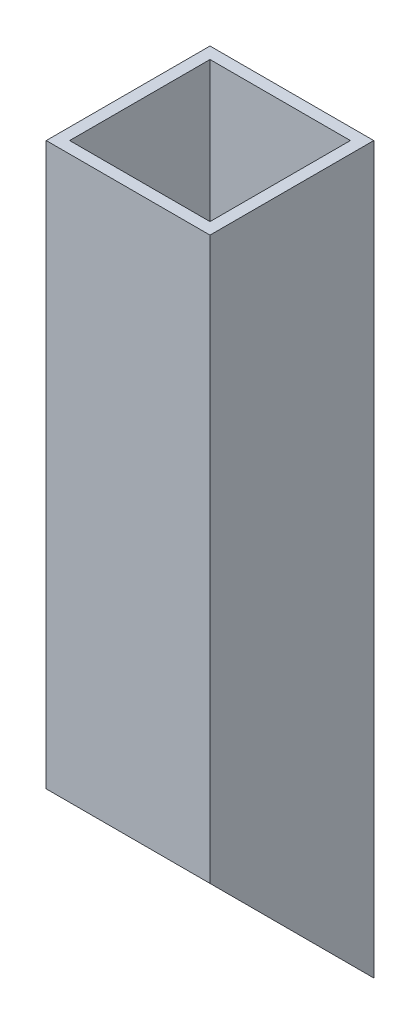
ISO-10303-21;
HEADER;
FILE_DESCRIPTION(('STEP AP214'),'2;1');
FILE_NAME('part.step','',(''),(''),'','','');
FILE_SCHEMA(('AUTOMOTIVE_DESIGN { 1 0 10303 214 1 1 1 1 }'));
ENDSEC;
DATA;
#1=APPLICATION_CONTEXT('core data for automotive mechanical design processes');
#2=APPLICATION_PROTOCOL_DEFINITION('international standard','automotive_design',2000,#1);
#3=PRODUCT_CONTEXT('',#1,'mechanical');
#4=PRODUCT('Part','Part','',(#3));
#5=PRODUCT_RELATED_PRODUCT_CATEGORY('part','',(#4));
#6=PRODUCT_DEFINITION_FORMATION('','',#4);
#7=PRODUCT_DEFINITION_CONTEXT('part definition',#1,'design');
#8=PRODUCT_DEFINITION('design','',#6,#7);
#9=PRODUCT_DEFINITION_SHAPE('','',#8);
#10=(LENGTH_UNIT() NAMED_UNIT(*) SI_UNIT(.MILLI.,.METRE.));
#11=(NAMED_UNIT(*) PLANE_ANGLE_UNIT() SI_UNIT($,.RADIAN.));
#12=(NAMED_UNIT(*) SI_UNIT($,.STERADIAN.) SOLID_ANGLE_UNIT());
#13=UNCERTAINTY_MEASURE_WITH_UNIT(LENGTH_MEASURE(1.E-05),#10,'distance_accuracy_value','');
#14=(GEOMETRIC_REPRESENTATION_CONTEXT(3) GLOBAL_UNCERTAINTY_ASSIGNED_CONTEXT((#13)) GLOBAL_UNIT_ASSIGNED_CONTEXT((#10,
#11,#12)) REPRESENTATION_CONTEXT('',''));
#15=CARTESIAN_POINT('',(0.,0.,0.));
#16=DIRECTION('',(0.,0.,1.));
#17=DIRECTION('',(1.,0.,0.));
#18=AXIS2_PLACEMENT_3D('',#15,#16,#17);
#19=CARTESIAN_POINT('',(1.89084858881472E-13,196.85,0.));
#20=DIRECTION('',(0.,-1.,0.));
#21=DIRECTION('',(0.,0.,-1.));
#22=AXIS2_PLACEMENT_3D('',#19,#20,#21);
#23=PLANE('',#22);
#24=DIRECTION('',(0.,0.,1.));
#25=VECTOR('',#24,1.);
#26=CARTESIAN_POINT('',(1.89084858881472E-13,196.85,0.));
#27=LINE('',#26,#25);
#28=CARTESIAN_POINT('',(1.89084858881472E-13,196.85,-44.45));
#29=VERTEX_POINT('',#28);
#30=CARTESIAN_POINT('',(1.89084858881472E-13,196.85,0.));
#31=VERTEX_POINT('',#30);
#32=EDGE_CURVE('E121',#29,#31,#27,.T.);
#33=ORIENTED_EDGE('',*,*,#32,.T.);
#34=DIRECTION('',(1.,0.,0.));
#35=VECTOR('',#34,1.);
#36=CARTESIAN_POINT('',(1.89084858881472E-13,196.85,0.));
#37=LINE('',#36,#35);
#38=CARTESIAN_POINT('',(44.4500000000002,196.85,0.));
#39=VERTEX_POINT('',#38);
#40=EDGE_CURVE('E127',#31,#39,#37,.T.);
#41=ORIENTED_EDGE('',*,*,#40,.T.);
#42=DIRECTION('',(0.,0.,-1.));
#43=VECTOR('',#42,1.);
#44=CARTESIAN_POINT('',(44.4500000000002,196.85,0.));
#45=LINE('',#44,#43);
#46=CARTESIAN_POINT('',(44.4500000000002,196.85,-44.45));
#47=VERTEX_POINT('',#46);
#48=EDGE_CURVE('E124',#39,#47,#45,.T.);
#49=ORIENTED_EDGE('',*,*,#48,.T.);
#50=DIRECTION('',(-1.,0.,0.));
#51=VECTOR('',#50,1.);
#52=CARTESIAN_POINT('',(1.89084858881472E-13,196.85,-44.45));
#53=LINE('',#52,#51);
#54=EDGE_CURVE('E118',#47,#29,#53,.T.);
#55=ORIENTED_EDGE('',*,*,#54,.T.);
#56=EDGE_LOOP('',(#33,#41,#49,#55));
#57=FACE_BOUND('',#56,.T.);
#58=DIRECTION('',(1.,0.,0.));
#59=VECTOR('',#58,1.);
#60=CARTESIAN_POINT('',(3.17500000000019,196.85,-3.175));
#61=LINE('',#60,#59);
#62=CARTESIAN_POINT('',(3.17500000000019,196.85,-3.175));
#63=VERTEX_POINT('',#62);
#64=CARTESIAN_POINT('',(41.2750000000002,196.85,-3.17499999999989));
#65=VERTEX_POINT('',#64);
#66=EDGE_CURVE('E89',#63,#65,#61,.T.);
#67=ORIENTED_EDGE('',*,*,#66,.F.);
#68=DIRECTION('',(0.,0.,1.));
#69=VECTOR('',#68,1.);
#70=CARTESIAN_POINT('',(3.17500000000019,196.85,-3.175));
#71=LINE('',#70,#69);
#72=CARTESIAN_POINT('',(3.17500000000019,196.85,-41.275));
#73=VERTEX_POINT('',#72);
#74=EDGE_CURVE('E137',#73,#63,#71,.T.);
#75=ORIENTED_EDGE('',*,*,#74,.F.);
#76=DIRECTION('',(-1.,0.,0.));
#77=VECTOR('',#76,1.);
#78=CARTESIAN_POINT('',(3.17500000000019,196.85,-41.275));
#79=LINE('',#78,#77);
#80=CARTESIAN_POINT('',(41.2750000000001,196.85,-41.275));
#81=VERTEX_POINT('',#80);
#82=EDGE_CURVE('E140',#81,#73,#79,.T.);
#83=ORIENTED_EDGE('',*,*,#82,.F.);
#84=DIRECTION('',(0.,0.,-1.));
#85=VECTOR('',#84,1.);
#86=CARTESIAN_POINT('',(41.2750000000002,196.85,-3.17499999999989));
#87=LINE('',#86,#85);
#88=EDGE_CURVE('E99',#65,#81,#87,.T.);
#89=ORIENTED_EDGE('',*,*,#88,.F.);
#90=EDGE_LOOP('',(#67,#75,#83,#89));
#91=FACE_BOUND('',#90,.T.);
#92=ADVANCED_FACE('F34',(#57,#91),#23,.F.);
#93=CARTESIAN_POINT('',(1.89084858881472E-13,196.85,0.));
#94=DIRECTION('',(1.,0.,0.));
#95=DIRECTION('',(0.,0.,-1.));
#96=AXIS2_PLACEMENT_3D('',#93,#94,#95);
#97=PLANE('',#96);
#98=DIRECTION('',(0.,-1.,0.));
#99=VECTOR('',#98,1.);
#100=CARTESIAN_POINT('',(1.89084858881472E-13,196.85,-44.45));
#101=LINE('',#100,#99);
#102=CARTESIAN_POINT('',(0.,0.,-44.45));
#103=VERTEX_POINT('',#102);
#104=EDGE_CURVE('E116',#29,#103,#101,.T.);
#105=ORIENTED_EDGE('',*,*,#104,.T.);
#106=DIRECTION('',(0.,0.707106781186546,0.707106781186549));
#107=VECTOR('',#106,1.);
#108=CARTESIAN_POINT('',(0.,44.45,0.));
#109=LINE('',#108,#107);
#110=CARTESIAN_POINT('',(0.,44.45,0.));
#111=VERTEX_POINT('',#110);
#112=EDGE_CURVE('E11',#103,#111,#109,.T.);
#113=ORIENTED_EDGE('',*,*,#112,.T.);
#114=DIRECTION('',(0.,-1.,0.));
#115=VECTOR('',#114,1.);
#116=CARTESIAN_POINT('',(1.89084858881472E-13,196.85,0.));
#117=LINE('',#116,#115);
#118=EDGE_CURVE('E108',#31,#111,#117,.T.);
#119=ORIENTED_EDGE('',*,*,#118,.F.);
#120=ORIENTED_EDGE('',*,*,#32,.F.);
#121=EDGE_LOOP('',(#105,#113,#119,#120));
#122=FACE_BOUND('',#121,.T.);
#123=ADVANCED_FACE('F174',(#122),#97,.F.);
#124=CARTESIAN_POINT('',(1.89084858881472E-13,196.85,0.));
#125=DIRECTION('',(0.,0.,-1.));
#126=DIRECTION('',(-1.,0.,0.));
#127=AXIS2_PLACEMENT_3D('',#124,#125,#126);
#128=PLANE('',#127);
#129=ORIENTED_EDGE('',*,*,#118,.T.);
#130=DIRECTION('',(1.,0.,0.));
#131=VECTOR('',#130,1.);
#132=CARTESIAN_POINT('',(44.4500000000001,44.4500000000001,0.));
#133=LINE('',#132,#131);
#134=CARTESIAN_POINT('',(44.4500000000001,44.4500000000001,0.));
#135=VERTEX_POINT('',#134);
#136=EDGE_CURVE('E105',#111,#135,#133,.T.);
#137=ORIENTED_EDGE('',*,*,#136,.T.);
#138=DIRECTION('',(0.,-1.,0.));
#139=VECTOR('',#138,1.);
#140=CARTESIAN_POINT('',(44.4500000000002,196.85,0.));
#141=LINE('',#140,#139);
#142=EDGE_CURVE('E110',#39,#135,#141,.T.);
#143=ORIENTED_EDGE('',*,*,#142,.F.);
#144=ORIENTED_EDGE('',*,*,#40,.F.);
#145=EDGE_LOOP('',(#129,#137,#143,#144));
#146=FACE_BOUND('',#145,.T.);
#147=ADVANCED_FACE('F178',(#146),#128,.F.);
#148=CARTESIAN_POINT('',(44.4500000000002,196.85,0.));
#149=DIRECTION('',(-1.,0.,0.));
#150=DIRECTION('',(0.,0.,1.));
#151=AXIS2_PLACEMENT_3D('',#148,#149,#150);
#152=PLANE('',#151);
#153=ORIENTED_EDGE('',*,*,#142,.T.);
#154=DIRECTION('',(0.,-0.707106781186546,-0.707106781186549));
#155=VECTOR('',#154,1.);
#156=CARTESIAN_POINT('',(44.4500000000001,44.4500000000001,0.));
#157=LINE('',#156,#155);
#158=CARTESIAN_POINT('',(44.45,1.2490009027033E-13,-44.45));
#159=VERTEX_POINT('',#158);
#160=EDGE_CURVE('E44',#135,#159,#157,.T.);
#161=ORIENTED_EDGE('',*,*,#160,.T.);
#162=DIRECTION('',(0.,-1.,0.));
#163=VECTOR('',#162,1.);
#164=CARTESIAN_POINT('',(44.4500000000002,196.85,-44.45));
#165=LINE('',#164,#163);
#166=EDGE_CURVE('E113',#47,#159,#165,.T.);
#167=ORIENTED_EDGE('',*,*,#166,.F.);
#168=ORIENTED_EDGE('',*,*,#48,.F.);
#169=EDGE_LOOP('',(#153,#161,#167,#168));
#170=FACE_BOUND('',#169,.T.);
#171=ADVANCED_FACE('F181',(#170),#152,.F.);
#172=CARTESIAN_POINT('',(1.89084858881472E-13,196.85,-44.45));
#173=DIRECTION('',(0.,0.,1.));
#174=DIRECTION('',(1.,0.,0.));
#175=AXIS2_PLACEMENT_3D('',#172,#173,#174);
#176=PLANE('',#175);
#177=DIRECTION('',(-1.,0.,0.));
#178=VECTOR('',#177,1.);
#179=CARTESIAN_POINT('',(0.,0.,-44.45));
#180=LINE('',#179,#178);
#181=EDGE_CURVE('E90',#159,#103,#180,.T.);
#182=ORIENTED_EDGE('',*,*,#181,.T.);
#183=ORIENTED_EDGE('',*,*,#104,.F.);
#184=ORIENTED_EDGE('',*,*,#54,.F.);
#185=ORIENTED_EDGE('',*,*,#166,.T.);
#186=EDGE_LOOP('',(#182,#183,#184,#185));
#187=FACE_BOUND('',#186,.T.);
#188=ADVANCED_FACE('F169',(#187),#176,.F.);
#189=CARTESIAN_POINT('',(3.17500000000019,196.85,-3.175));
#190=DIRECTION('',(0.,0.,-1.));
#191=DIRECTION('',(-1.,0.,0.));
#192=AXIS2_PLACEMENT_3D('',#189,#190,#191);
#193=PLANE('',#192);
#194=DIRECTION('',(1.,0.,0.));
#195=VECTOR('',#194,1.);
#196=CARTESIAN_POINT('',(0.,41.275,-3.175));
#197=LINE('',#196,#195);
#198=CARTESIAN_POINT('',(3.17500000000006,41.275,-3.175));
#199=VERTEX_POINT('',#198);
#200=CARTESIAN_POINT('',(41.2750000000001,41.2750000000001,-3.17499999999989));
#201=VERTEX_POINT('',#200);
#202=EDGE_CURVE('E38',#199,#201,#197,.T.);
#203=ORIENTED_EDGE('',*,*,#202,.F.);
#204=DIRECTION('',(0.,-1.,0.));
#205=VECTOR('',#204,1.);
#206=CARTESIAN_POINT('',(3.17500000000019,196.85,-3.175));
#207=LINE('',#206,#205);
#208=EDGE_CURVE('E135',#63,#199,#207,.T.);
#209=ORIENTED_EDGE('',*,*,#208,.F.);
#210=ORIENTED_EDGE('',*,*,#66,.T.);
#211=DIRECTION('',(0.,-1.,0.));
#212=VECTOR('',#211,1.);
#213=CARTESIAN_POINT('',(41.2750000000002,196.85,-3.17499999999989));
#214=LINE('',#213,#212);
#215=EDGE_CURVE('E73',#65,#201,#214,.T.);
#216=ORIENTED_EDGE('',*,*,#215,.T.);
#217=EDGE_LOOP('',(#203,#209,#210,#216));
#218=FACE_BOUND('',#217,.T.);
#219=ADVANCED_FACE('F85',(#218),#193,.T.);
#220=CARTESIAN_POINT('',(41.2750000000002,196.85,-3.17499999999989));
#221=DIRECTION('',(-1.,0.,0.));
#222=DIRECTION('',(0.,0.,1.));
#223=AXIS2_PLACEMENT_3D('',#220,#221,#222);
#224=PLANE('',#223);
#225=DIRECTION('',(0.,-0.707106781186546,-0.707106781186549));
#226=VECTOR('',#225,1.);
#227=CARTESIAN_POINT('',(41.2750000000001,44.4500000000001,1.11022302462516E-13));
#228=LINE('',#227,#226);
#229=CARTESIAN_POINT('',(41.2749999999999,3.17500000000018,-41.275));
#230=VERTEX_POINT('',#229);
#231=EDGE_CURVE('E69',#201,#230,#228,.T.);
#232=ORIENTED_EDGE('',*,*,#231,.F.);
#233=ORIENTED_EDGE('',*,*,#215,.F.);
#234=ORIENTED_EDGE('',*,*,#88,.T.);
#235=DIRECTION('',(0.,-1.,0.));
#236=VECTOR('',#235,1.);
#237=CARTESIAN_POINT('',(41.2750000000001,196.85,-41.275));
#238=LINE('',#237,#236);
#239=EDGE_CURVE('E76',#81,#230,#238,.T.);
#240=ORIENTED_EDGE('',*,*,#239,.T.);
#241=EDGE_LOOP('',(#232,#233,#234,#240));
#242=FACE_BOUND('',#241,.T.);
#243=ADVANCED_FACE('F71',(#242),#224,.T.);
#244=CARTESIAN_POINT('',(3.17500000000019,196.85,-41.275));
#245=DIRECTION('',(0.,0.,1.));
#246=DIRECTION('',(1.,0.,0.));
#247=AXIS2_PLACEMENT_3D('',#244,#245,#246);
#248=PLANE('',#247);
#249=DIRECTION('',(-1.,0.,0.));
#250=VECTOR('',#249,1.);
#251=CARTESIAN_POINT('',(0.,3.17500000000015,-41.275));
#252=LINE('',#251,#250);
#253=CARTESIAN_POINT('',(3.175,3.17500000000018,-41.275));
#254=VERTEX_POINT('',#253);
#255=EDGE_CURVE('E81',#230,#254,#252,.T.);
#256=ORIENTED_EDGE('',*,*,#255,.F.);
#257=ORIENTED_EDGE('',*,*,#239,.F.);
#258=ORIENTED_EDGE('',*,*,#82,.T.);
#259=DIRECTION('',(0.,-1.,0.));
#260=VECTOR('',#259,1.);
#261=CARTESIAN_POINT('',(3.17500000000019,196.85,-41.275));
#262=LINE('',#261,#260);
#263=EDGE_CURVE('E133',#73,#254,#262,.T.);
#264=ORIENTED_EDGE('',*,*,#263,.T.);
#265=EDGE_LOOP('',(#256,#257,#258,#264));
#266=FACE_BOUND('',#265,.T.);
#267=ADVANCED_FACE('F149',(#266),#248,.T.);
#268=CARTESIAN_POINT('',(3.17500000000019,196.85,-3.175));
#269=DIRECTION('',(1.,0.,0.));
#270=DIRECTION('',(0.,0.,-1.));
#271=AXIS2_PLACEMENT_3D('',#268,#269,#270);
#272=PLANE('',#271);
#273=DIRECTION('',(0.,0.707106781186546,0.707106781186549));
#274=VECTOR('',#273,1.);
#275=CARTESIAN_POINT('',(3.17500000000006,44.45,0.));
#276=LINE('',#275,#274);
#277=EDGE_CURVE('E94',#254,#199,#276,.T.);
#278=ORIENTED_EDGE('',*,*,#277,.F.);
#279=ORIENTED_EDGE('',*,*,#263,.F.);
#280=ORIENTED_EDGE('',*,*,#74,.T.);
#281=ORIENTED_EDGE('',*,*,#208,.T.);
#282=EDGE_LOOP('',(#278,#279,#280,#281));
#283=FACE_BOUND('',#282,.T.);
#284=ADVANCED_FACE('F151',(#283),#272,.T.);
#285=CARTESIAN_POINT('',(0.,44.45,0.));
#286=DIRECTION('',(0.,-0.707106781186549,0.707106781186546));
#287=DIRECTION('',(-1.,0.,0.));
#288=AXIS2_PLACEMENT_3D('',#285,#286,#287);
#289=PLANE('',#288);
#290=ORIENTED_EDGE('',*,*,#112,.F.);
#291=ORIENTED_EDGE('',*,*,#181,.F.);
#292=ORIENTED_EDGE('',*,*,#160,.F.);
#293=ORIENTED_EDGE('',*,*,#136,.F.);
#294=EDGE_LOOP('',(#290,#291,#292,#293));
#295=FACE_BOUND('',#294,.T.);
#296=ORIENTED_EDGE('',*,*,#277,.T.);
#297=ORIENTED_EDGE('',*,*,#202,.T.);
#298=ORIENTED_EDGE('',*,*,#231,.T.);
#299=ORIENTED_EDGE('',*,*,#255,.T.);
#300=EDGE_LOOP('',(#296,#297,#298,#299));
#301=FACE_BOUND('',#300,.T.);
#302=ADVANCED_FACE('F36',(#295,#301),#289,.T.);
#303=CLOSED_SHELL('',(#92,#123,#147,#171,#188,#219,#243,#267,#284,#302));
#304=MANIFOLD_SOLID_BREP('B2',#303);
#305=ADVANCED_BREP_SHAPE_REPRESENTATION('',(#18,#304),#14);
#306=SHAPE_DEFINITION_REPRESENTATION(#9,#305);
ENDSEC;
END-ISO-10303-21;
